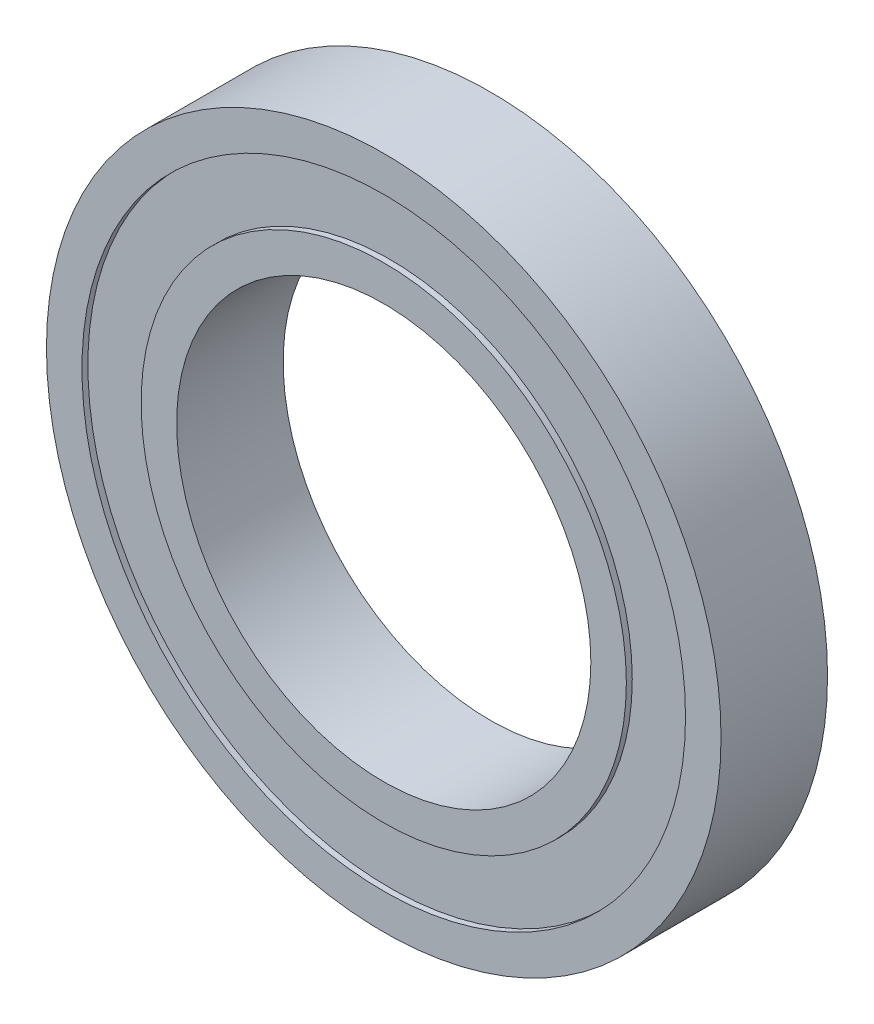
ISO-10303-21;
HEADER;
FILE_DESCRIPTION(('STEP AP214'),'2;1');
FILE_NAME('part.step','',(''),(''),'','','');
FILE_SCHEMA(('AUTOMOTIVE_DESIGN { 1 0 10303 214 1 1 1 1 }'));
ENDSEC;
DATA;
#1=APPLICATION_CONTEXT('core data for automotive mechanical design processes');
#2=APPLICATION_PROTOCOL_DEFINITION('international standard','automotive_design',2000,#1);
#3=PRODUCT_CONTEXT('',#1,'mechanical');
#4=PRODUCT('Part','Part','',(#3));
#5=PRODUCT_RELATED_PRODUCT_CATEGORY('part','',(#4));
#6=PRODUCT_DEFINITION_FORMATION('','',#4);
#7=PRODUCT_DEFINITION_CONTEXT('part definition',#1,'design');
#8=PRODUCT_DEFINITION('design','',#6,#7);
#9=PRODUCT_DEFINITION_SHAPE('','',#8);
#10=(LENGTH_UNIT() NAMED_UNIT(*) SI_UNIT(.MILLI.,.METRE.));
#11=(NAMED_UNIT(*) PLANE_ANGLE_UNIT() SI_UNIT($,.RADIAN.));
#12=(NAMED_UNIT(*) SI_UNIT($,.STERADIAN.) SOLID_ANGLE_UNIT());
#13=UNCERTAINTY_MEASURE_WITH_UNIT(LENGTH_MEASURE(1.E-05),#10,'distance_accuracy_value','');
#14=(GEOMETRIC_REPRESENTATION_CONTEXT(3) GLOBAL_UNCERTAINTY_ASSIGNED_CONTEXT((#13)) GLOBAL_UNIT_ASSIGNED_CONTEXT((#10,
#11,#12)) REPRESENTATION_CONTEXT('',''));
#15=CARTESIAN_POINT('',(0.,0.,0.));
#16=DIRECTION('',(0.,0.,1.));
#17=DIRECTION('',(1.,0.,0.));
#18=AXIS2_PLACEMENT_3D('',#15,#16,#17);
#19=CARTESIAN_POINT('',(0.,0.,9.));
#20=DIRECTION('',(0.,0.,-1.));
#21=DIRECTION('',(-1.,0.,0.));
#22=AXIS2_PLACEMENT_3D('',#19,#20,#21);
#23=CYLINDRICAL_SURFACE('',#22,20.5);
#24=CARTESIAN_POINT('',(0.,0.,0.));
#25=DIRECTION('',(0.,0.,1.));
#26=DIRECTION('',(1.,0.,0.));
#27=AXIS2_PLACEMENT_3D('',#24,#25,#26);
#28=CIRCLE('',#27,20.5);
#29=CARTESIAN_POINT('',(20.5,0.,0.));
#30=VERTEX_POINT('',#29);
#31=EDGE_CURVE('E61',#30,#30,#28,.T.);
#32=ORIENTED_EDGE('',*,*,#31,.T.);
#33=EDGE_LOOP('',(#32));
#34=FACE_BOUND('',#33,.T.);
#35=CARTESIAN_POINT('',(0.,0.,0.5));
#36=DIRECTION('',(0.,0.,1.));
#37=DIRECTION('',(1.,0.,0.));
#38=AXIS2_PLACEMENT_3D('',#35,#36,#37);
#39=CIRCLE('',#38,20.5);
#40=CARTESIAN_POINT('',(20.5,0.,0.5));
#41=VERTEX_POINT('',#40);
#42=EDGE_CURVE('E11',#41,#41,#39,.T.);
#43=ORIENTED_EDGE('',*,*,#42,.F.);
#44=EDGE_LOOP('',(#43));
#45=FACE_BOUND('',#44,.T.);
#46=ADVANCED_FACE('F45',(#34,#45),#23,.T.);
#47=CARTESIAN_POINT('',(0.,0.,9.));
#48=DIRECTION('',(0.,0.,-1.));
#49=DIRECTION('',(-1.,0.,0.));
#50=AXIS2_PLACEMENT_3D('',#47,#48,#49);
#51=CYLINDRICAL_SURFACE('',#50,17.5);
#52=CARTESIAN_POINT('',(0.,0.,9.));
#53=DIRECTION('',(0.,0.,1.));
#54=DIRECTION('',(1.,0.,0.));
#55=AXIS2_PLACEMENT_3D('',#52,#53,#54);
#56=CIRCLE('',#55,17.5);
#57=CARTESIAN_POINT('',(17.5,0.,9.));
#58=VERTEX_POINT('',#57);
#59=EDGE_CURVE('E56',#58,#58,#56,.T.);
#60=ORIENTED_EDGE('',*,*,#59,.T.);
#61=EDGE_LOOP('',(#60));
#62=FACE_BOUND('',#61,.T.);
#63=CARTESIAN_POINT('',(0.,0.,0.));
#64=DIRECTION('',(0.,0.,1.));
#65=DIRECTION('',(1.,0.,0.));
#66=AXIS2_PLACEMENT_3D('',#63,#64,#65);
#67=CIRCLE('',#66,17.5);
#68=CARTESIAN_POINT('',(17.5,0.,0.));
#69=VERTEX_POINT('',#68);
#70=EDGE_CURVE('E65',#69,#69,#67,.T.);
#71=ORIENTED_EDGE('',*,*,#70,.F.);
#72=EDGE_LOOP('',(#71));
#73=FACE_BOUND('',#72,.T.);
#74=ADVANCED_FACE('F47',(#62,#73),#51,.F.);
#75=CARTESIAN_POINT('',(0.,0.,8.5));
#76=DIRECTION('',(0.,0.,1.));
#77=DIRECTION('',(1.,0.,0.));
#78=AXIS2_PLACEMENT_3D('',#75,#76,#77);
#79=CIRCLE('',#78,20.5);
#80=CARTESIAN_POINT('',(20.5,0.,8.5));
#81=VERTEX_POINT('',#80);
#82=EDGE_CURVE('E67',#81,#81,#79,.T.);
#83=ORIENTED_EDGE('',*,*,#82,.T.);
#84=EDGE_LOOP('',(#83));
#85=FACE_BOUND('',#84,.T.);
#86=CARTESIAN_POINT('',(0.,0.,9.));
#87=DIRECTION('',(0.,0.,1.));
#88=DIRECTION('',(1.,0.,0.));
#89=AXIS2_PLACEMENT_3D('',#86,#87,#88);
#90=CIRCLE('',#89,20.5);
#91=CARTESIAN_POINT('',(20.5,0.,9.));
#92=VERTEX_POINT('',#91);
#93=EDGE_CURVE('E52',#92,#92,#90,.T.);
#94=ORIENTED_EDGE('',*,*,#93,.F.);
#95=EDGE_LOOP('',(#94));
#96=FACE_BOUND('',#95,.T.);
#97=ADVANCED_FACE('F87',(#85,#96),#23,.T.);
#98=CARTESIAN_POINT('',(0.,0.,9.));
#99=DIRECTION('',(0.,0.,1.));
#100=DIRECTION('',(1.,0.,0.));
#101=AXIS2_PLACEMENT_3D('',#98,#99,#100);
#102=PLANE('',#101);
#103=ORIENTED_EDGE('',*,*,#59,.F.);
#104=EDGE_LOOP('',(#103));
#105=FACE_BOUND('',#104,.T.);
#106=ORIENTED_EDGE('',*,*,#93,.T.);
#107=EDGE_LOOP('',(#106));
#108=FACE_BOUND('',#107,.T.);
#109=ADVANCED_FACE('F76',(#105,#108),#102,.T.);
#110=CARTESIAN_POINT('',(0.,0.,0.));
#111=DIRECTION('',(0.,0.,1.));
#112=DIRECTION('',(1.,0.,0.));
#113=AXIS2_PLACEMENT_3D('',#110,#111,#112);
#114=PLANE('',#113);
#115=ORIENTED_EDGE('',*,*,#70,.T.);
#116=EDGE_LOOP('',(#115));
#117=FACE_BOUND('',#116,.T.);
#118=ORIENTED_EDGE('',*,*,#31,.F.);
#119=EDGE_LOOP('',(#118));
#120=FACE_BOUND('',#119,.T.);
#121=ADVANCED_FACE('F73',(#117,#120),#114,.F.);
#122=CARTESIAN_POINT('',(0.,0.,8.5));
#123=DIRECTION('',(0.,0.,1.));
#124=DIRECTION('',(1.,0.,0.));
#125=AXIS2_PLACEMENT_3D('',#122,#123,#124);
#126=PLANE('',#125);
#127=ORIENTED_EDGE('',*,*,#82,.F.);
#128=EDGE_LOOP('',(#127));
#129=FACE_BOUND('',#128,.T.);
#130=CARTESIAN_POINT('',(0.,0.,8.5));
#131=DIRECTION('',(0.,0.,1.));
#132=DIRECTION('',(1.,0.,0.));
#133=AXIS2_PLACEMENT_3D('',#130,#131,#132);
#134=CIRCLE('',#133,25.5);
#135=CARTESIAN_POINT('',(25.5,0.,8.5));
#136=VERTEX_POINT('',#135);
#137=EDGE_CURVE('E104',#136,#136,#134,.F.);
#138=ORIENTED_EDGE('',*,*,#137,.F.);
#139=EDGE_LOOP('',(#138));
#140=FACE_BOUND('',#139,.T.);
#141=ADVANCED_FACE('F75',(#129,#140),#126,.T.);
#142=CARTESIAN_POINT('',(0.,0.,0.5));
#143=DIRECTION('',(0.,0.,1.));
#144=DIRECTION('',(1.,0.,0.));
#145=AXIS2_PLACEMENT_3D('',#142,#143,#144);
#146=PLANE('',#145);
#147=ORIENTED_EDGE('',*,*,#42,.T.);
#148=EDGE_LOOP('',(#147));
#149=FACE_BOUND('',#148,.T.);
#150=CARTESIAN_POINT('',(0.,0.,0.5));
#151=DIRECTION('',(0.,0.,1.));
#152=DIRECTION('',(1.,0.,0.));
#153=AXIS2_PLACEMENT_3D('',#150,#151,#152);
#154=CIRCLE('',#153,25.5);
#155=CARTESIAN_POINT('',(25.5,0.,0.5));
#156=VERTEX_POINT('',#155);
#157=EDGE_CURVE('E101',#156,#156,#154,.T.);
#158=ORIENTED_EDGE('',*,*,#157,.F.);
#159=EDGE_LOOP('',(#158));
#160=FACE_BOUND('',#159,.T.);
#161=ADVANCED_FACE('F84',(#149,#160),#146,.F.);
#162=CARTESIAN_POINT('',(0.,0.,9.));
#163=DIRECTION('',(0.,0.,-1.));
#164=DIRECTION('',(-1.,0.,0.));
#165=AXIS2_PLACEMENT_3D('',#162,#163,#164);
#166=CYLINDRICAL_SURFACE('',#165,25.5);
#167=CARTESIAN_POINT('',(0.,0.,0.));
#168=DIRECTION('',(0.,0.,1.));
#169=DIRECTION('',(1.,0.,0.));
#170=AXIS2_PLACEMENT_3D('',#167,#168,#169);
#171=CIRCLE('',#170,25.5);
#172=CARTESIAN_POINT('',(25.5,0.,0.));
#173=VERTEX_POINT('',#172);
#174=EDGE_CURVE('E113',#173,#173,#171,.T.);
#175=ORIENTED_EDGE('',*,*,#174,.F.);
#176=EDGE_LOOP('',(#175));
#177=FACE_BOUND('',#176,.T.);
#178=ORIENTED_EDGE('',*,*,#157,.T.);
#179=EDGE_LOOP('',(#178));
#180=FACE_BOUND('',#179,.T.);
#181=ADVANCED_FACE('F143',(#177,#180),#166,.F.);
#182=ORIENTED_EDGE('',*,*,#137,.T.);
#183=EDGE_LOOP('',(#182));
#184=FACE_BOUND('',#183,.T.);
#185=CARTESIAN_POINT('',(0.,0.,9.));
#186=DIRECTION('',(0.,0.,1.));
#187=DIRECTION('',(1.,0.,0.));
#188=AXIS2_PLACEMENT_3D('',#185,#186,#187);
#189=CIRCLE('',#188,25.5);
#190=CARTESIAN_POINT('',(25.5,0.,9.));
#191=VERTEX_POINT('',#190);
#192=EDGE_CURVE('E112',#191,#191,#189,.T.);
#193=ORIENTED_EDGE('',*,*,#192,.T.);
#194=EDGE_LOOP('',(#193));
#195=FACE_BOUND('',#194,.T.);
#196=ADVANCED_FACE('F121',(#184,#195),#166,.F.);
#197=CARTESIAN_POINT('',(0.,0.,9.));
#198=DIRECTION('',(0.,0.,-1.));
#199=DIRECTION('',(-1.,0.,0.));
#200=AXIS2_PLACEMENT_3D('',#197,#198,#199);
#201=CYLINDRICAL_SURFACE('',#200,28.5);
#202=CARTESIAN_POINT('',(0.,0.,9.));
#203=DIRECTION('',(0.,0.,1.));
#204=DIRECTION('',(1.,0.,0.));
#205=AXIS2_PLACEMENT_3D('',#202,#203,#204);
#206=CIRCLE('',#205,28.5);
#207=CARTESIAN_POINT('',(28.5,0.,9.));
#208=VERTEX_POINT('',#207);
#209=EDGE_CURVE('E108',#208,#208,#206,.T.);
#210=ORIENTED_EDGE('',*,*,#209,.F.);
#211=EDGE_LOOP('',(#210));
#212=FACE_BOUND('',#211,.T.);
#213=CARTESIAN_POINT('',(0.,0.,0.));
#214=DIRECTION('',(0.,0.,1.));
#215=DIRECTION('',(1.,0.,0.));
#216=AXIS2_PLACEMENT_3D('',#213,#214,#215);
#217=CIRCLE('',#216,28.5);
#218=CARTESIAN_POINT('',(28.5,0.,0.));
#219=VERTEX_POINT('',#218);
#220=EDGE_CURVE('E109',#219,#219,#217,.T.);
#221=ORIENTED_EDGE('',*,*,#220,.T.);
#222=EDGE_LOOP('',(#221));
#223=FACE_BOUND('',#222,.T.);
#224=ADVANCED_FACE('F127',(#212,#223),#201,.T.);
#225=CARTESIAN_POINT('',(0.,0.,9.));
#226=DIRECTION('',(0.,0.,1.));
#227=DIRECTION('',(1.,0.,0.));
#228=AXIS2_PLACEMENT_3D('',#225,#226,#227);
#229=PLANE('',#228);
#230=ORIENTED_EDGE('',*,*,#192,.F.);
#231=EDGE_LOOP('',(#230));
#232=FACE_BOUND('',#231,.T.);
#233=ORIENTED_EDGE('',*,*,#209,.T.);
#234=EDGE_LOOP('',(#233));
#235=FACE_BOUND('',#234,.T.);
#236=ADVANCED_FACE('F123',(#232,#235),#229,.T.);
#237=CARTESIAN_POINT('',(0.,0.,0.));
#238=DIRECTION('',(0.,0.,1.));
#239=DIRECTION('',(1.,0.,0.));
#240=AXIS2_PLACEMENT_3D('',#237,#238,#239);
#241=PLANE('',#240);
#242=ORIENTED_EDGE('',*,*,#174,.T.);
#243=EDGE_LOOP('',(#242));
#244=FACE_BOUND('',#243,.T.);
#245=ORIENTED_EDGE('',*,*,#220,.F.);
#246=EDGE_LOOP('',(#245));
#247=FACE_BOUND('',#246,.T.);
#248=ADVANCED_FACE('F126',(#244,#247),#241,.F.);
#249=CLOSED_SHELL('',(#46,#74,#97,#109,#121,#141,#161,#181,#196,#224,#236,#248));
#250=MANIFOLD_SOLID_BREP('B2',#249);
#251=ADVANCED_BREP_SHAPE_REPRESENTATION('',(#18,#250),#14);
#252=SHAPE_DEFINITION_REPRESENTATION(#9,#251);
ENDSEC;
END-ISO-10303-21;
